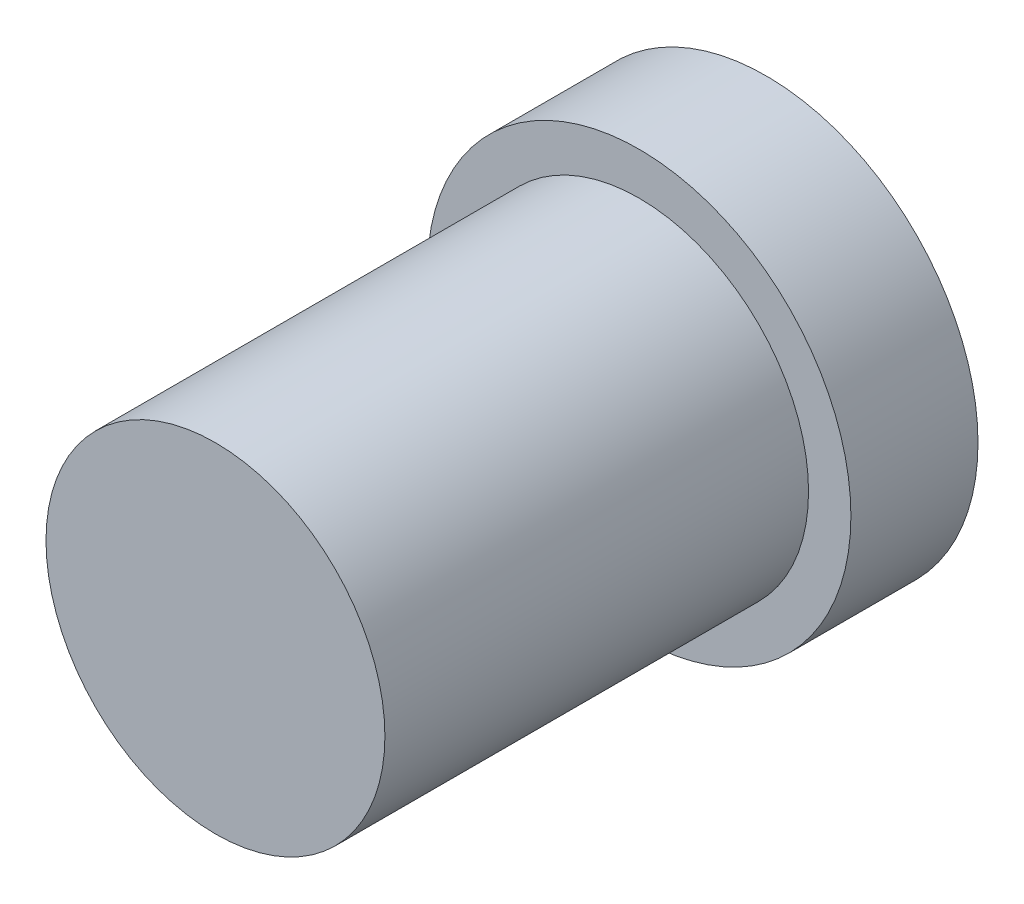
ISO-10303-21;
HEADER;
FILE_DESCRIPTION(('STEP AP214'),'2;1');
FILE_NAME('part.step','',(''),(''),'','','');
FILE_SCHEMA(('AUTOMOTIVE_DESIGN { 1 0 10303 214 1 1 1 1 }'));
ENDSEC;
DATA;
#1=APPLICATION_CONTEXT('core data for automotive mechanical design processes');
#2=APPLICATION_PROTOCOL_DEFINITION('international standard','automotive_design',2000,#1);
#3=PRODUCT_CONTEXT('',#1,'mechanical');
#4=PRODUCT('Part','Part','',(#3));
#5=PRODUCT_RELATED_PRODUCT_CATEGORY('part','',(#4));
#6=PRODUCT_DEFINITION_FORMATION('','',#4);
#7=PRODUCT_DEFINITION_CONTEXT('part definition',#1,'design');
#8=PRODUCT_DEFINITION('design','',#6,#7);
#9=PRODUCT_DEFINITION_SHAPE('','',#8);
#10=(LENGTH_UNIT() NAMED_UNIT(*) SI_UNIT(.MILLI.,.METRE.));
#11=(NAMED_UNIT(*) PLANE_ANGLE_UNIT() SI_UNIT($,.RADIAN.));
#12=(NAMED_UNIT(*) SI_UNIT($,.STERADIAN.) SOLID_ANGLE_UNIT());
#13=UNCERTAINTY_MEASURE_WITH_UNIT(LENGTH_MEASURE(1.E-05),#10,'distance_accuracy_value','');
#14=(GEOMETRIC_REPRESENTATION_CONTEXT(3) GLOBAL_UNCERTAINTY_ASSIGNED_CONTEXT((#13)) GLOBAL_UNIT_ASSIGNED_CONTEXT((#10,
#11,#12)) REPRESENTATION_CONTEXT('',''));
#15=CARTESIAN_POINT('',(0.,0.,0.));
#16=DIRECTION('',(0.,0.,1.));
#17=DIRECTION('',(1.,0.,0.));
#18=AXIS2_PLACEMENT_3D('',#15,#16,#17);
#19=CARTESIAN_POINT('',(0.,0.,3.));
#20=DIRECTION('',(0.,0.,-1.));
#21=DIRECTION('',(-1.,0.,0.));
#22=AXIS2_PLACEMENT_3D('',#19,#20,#21);
#23=CYLINDRICAL_SURFACE('',#22,5.);
#24=CARTESIAN_POINT('',(0.,0.,3.));
#25=DIRECTION('',(0.,0.,1.));
#26=DIRECTION('',(1.,0.,0.));
#27=AXIS2_PLACEMENT_3D('',#24,#25,#26);
#28=CIRCLE('',#27,5.);
#29=CARTESIAN_POINT('',(5.,0.,3.));
#30=VERTEX_POINT('',#29);
#31=EDGE_CURVE('E45',#30,#30,#28,.T.);
#32=ORIENTED_EDGE('',*,*,#31,.F.);
#33=EDGE_LOOP('',(#32));
#34=FACE_BOUND('',#33,.T.);
#35=CARTESIAN_POINT('',(0.,0.,0.));
#36=DIRECTION('',(0.,0.,1.));
#37=DIRECTION('',(1.,0.,0.));
#38=AXIS2_PLACEMENT_3D('',#35,#36,#37);
#39=CIRCLE('',#38,5.);
#40=CARTESIAN_POINT('',(5.,0.,0.));
#41=VERTEX_POINT('',#40);
#42=EDGE_CURVE('E40',#41,#41,#39,.T.);
#43=ORIENTED_EDGE('',*,*,#42,.T.);
#44=EDGE_LOOP('',(#43));
#45=FACE_BOUND('',#44,.T.);
#46=ADVANCED_FACE('F37',(#34,#45),#23,.T.);
#47=CARTESIAN_POINT('',(0.,0.,3.));
#48=DIRECTION('',(0.,0.,1.));
#49=DIRECTION('',(1.,0.,0.));
#50=AXIS2_PLACEMENT_3D('',#47,#48,#49);
#51=PLANE('',#50);
#52=CARTESIAN_POINT('',(0.,0.,3.));
#53=DIRECTION('',(0.,0.,1.));
#54=DIRECTION('',(1.,0.,0.));
#55=AXIS2_PLACEMENT_3D('',#52,#53,#54);
#56=CIRCLE('',#55,4.);
#57=CARTESIAN_POINT('',(4.,0.,3.));
#58=VERTEX_POINT('',#57);
#59=EDGE_CURVE('E10',#58,#58,#56,.T.);
#60=ORIENTED_EDGE('',*,*,#59,.F.);
#61=EDGE_LOOP('',(#60));
#62=FACE_BOUND('',#61,.T.);
#63=ORIENTED_EDGE('',*,*,#31,.T.);
#64=EDGE_LOOP('',(#63));
#65=FACE_BOUND('',#64,.T.);
#66=ADVANCED_FACE('F65',(#62,#65),#51,.T.);
#67=CARTESIAN_POINT('',(0.,0.,0.));
#68=DIRECTION('',(0.,0.,1.));
#69=DIRECTION('',(1.,0.,0.));
#70=AXIS2_PLACEMENT_3D('',#67,#68,#69);
#71=PLANE('',#70);
#72=ORIENTED_EDGE('',*,*,#42,.F.);
#73=EDGE_LOOP('',(#72));
#74=FACE_BOUND('',#73,.T.);
#75=ADVANCED_FACE('F62',(#74),#71,.F.);
#76=CARTESIAN_POINT('',(0.,0.,13.));
#77=DIRECTION('',(0.,0.,-1.));
#78=DIRECTION('',(-1.,0.,0.));
#79=AXIS2_PLACEMENT_3D('',#76,#77,#78);
#80=CYLINDRICAL_SURFACE('',#79,4.);
#81=CARTESIAN_POINT('',(0.,0.,13.));
#82=DIRECTION('',(0.,0.,1.));
#83=DIRECTION('',(1.,0.,0.));
#84=AXIS2_PLACEMENT_3D('',#81,#82,#83);
#85=CIRCLE('',#84,4.);
#86=CARTESIAN_POINT('',(4.,0.,13.));
#87=VERTEX_POINT('',#86);
#88=EDGE_CURVE('E52',#87,#87,#85,.T.);
#89=ORIENTED_EDGE('',*,*,#88,.F.);
#90=EDGE_LOOP('',(#89));
#91=FACE_BOUND('',#90,.T.);
#92=ORIENTED_EDGE('',*,*,#59,.T.);
#93=EDGE_LOOP('',(#92));
#94=FACE_BOUND('',#93,.T.);
#95=ADVANCED_FACE('F64',(#91,#94),#80,.T.);
#96=CARTESIAN_POINT('',(0.,0.,13.));
#97=DIRECTION('',(0.,0.,1.));
#98=DIRECTION('',(1.,0.,0.));
#99=AXIS2_PLACEMENT_3D('',#96,#97,#98);
#100=PLANE('',#99);
#101=ORIENTED_EDGE('',*,*,#88,.T.);
#102=EDGE_LOOP('',(#101));
#103=FACE_BOUND('',#102,.T.);
#104=ADVANCED_FACE('F70',(#103),#100,.T.);
#105=CLOSED_SHELL('',(#46,#66,#75,#95,#104));
#106=MANIFOLD_SOLID_BREP('B2',#105);
#107=ADVANCED_BREP_SHAPE_REPRESENTATION('',(#18,#106),#14);
#108=SHAPE_DEFINITION_REPRESENTATION(#9,#107);
ENDSEC;
END-ISO-10303-21;
